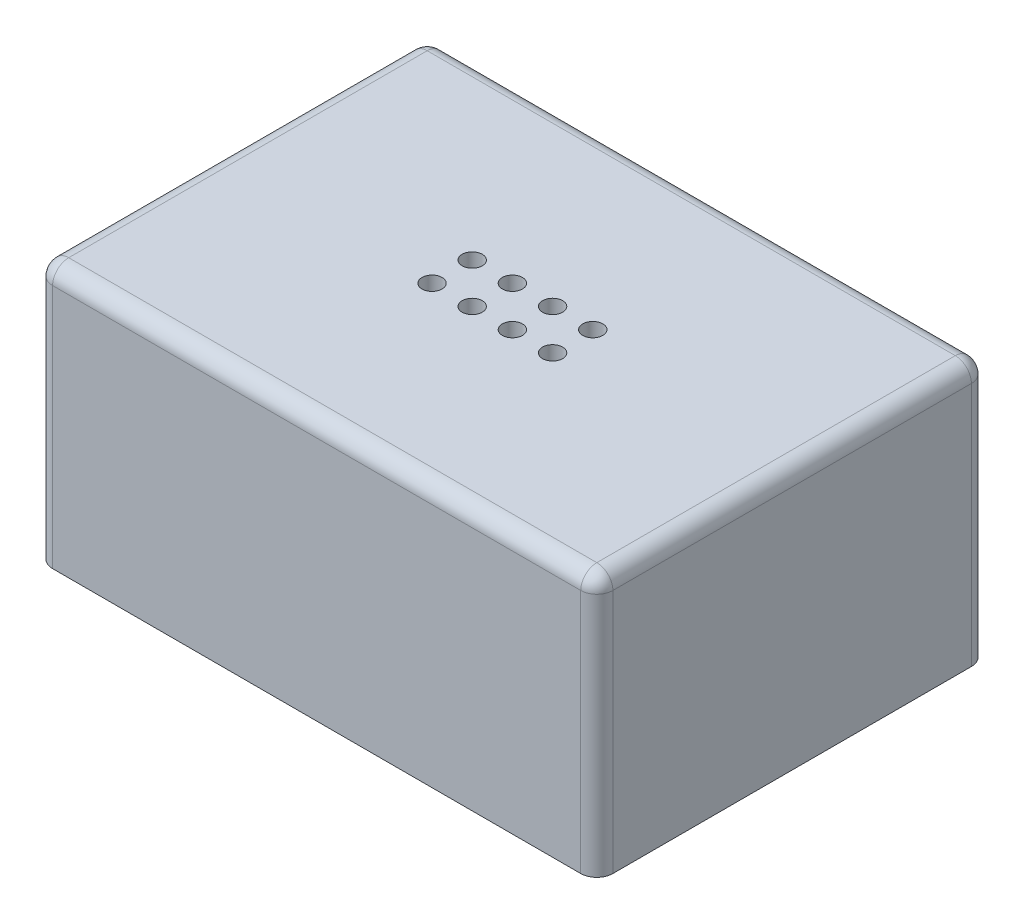
ISO-10303-21;
HEADER;
FILE_DESCRIPTION(('STEP AP214'),'2;1');
FILE_NAME('part.step','',(''),(''),'','','');
FILE_SCHEMA(('AUTOMOTIVE_DESIGN { 1 0 10303 214 1 1 1 1 }'));
ENDSEC;
DATA;
#1=APPLICATION_CONTEXT('core data for automotive mechanical design processes');
#2=APPLICATION_PROTOCOL_DEFINITION('international standard','automotive_design',2000,#1);
#3=PRODUCT_CONTEXT('',#1,'mechanical');
#4=PRODUCT('Part','Part','',(#3));
#5=PRODUCT_RELATED_PRODUCT_CATEGORY('part','',(#4));
#6=PRODUCT_DEFINITION_FORMATION('','',#4);
#7=PRODUCT_DEFINITION_CONTEXT('part definition',#1,'design');
#8=PRODUCT_DEFINITION('design','',#6,#7);
#9=PRODUCT_DEFINITION_SHAPE('','',#8);
#10=(LENGTH_UNIT() NAMED_UNIT(*) SI_UNIT(.MILLI.,.METRE.));
#11=(NAMED_UNIT(*) PLANE_ANGLE_UNIT() SI_UNIT($,.RADIAN.));
#12=(NAMED_UNIT(*) SI_UNIT($,.STERADIAN.) SOLID_ANGLE_UNIT());
#13=UNCERTAINTY_MEASURE_WITH_UNIT(LENGTH_MEASURE(1.E-05),#10,'distance_accuracy_value','');
#14=(GEOMETRIC_REPRESENTATION_CONTEXT(3) GLOBAL_UNCERTAINTY_ASSIGNED_CONTEXT((#13)) GLOBAL_UNIT_ASSIGNED_CONTEXT((#10,
#11,#12)) REPRESENTATION_CONTEXT('',''));
#15=CARTESIAN_POINT('',(0.,0.,0.));
#16=DIRECTION('',(0.,0.,1.));
#17=DIRECTION('',(1.,0.,0.));
#18=AXIS2_PLACEMENT_3D('',#15,#16,#17);
#19=CARTESIAN_POINT('',(0.,0.,0.));
#20=DIRECTION('',(0.,-1.,0.));
#21=DIRECTION('',(0.,0.,-1.));
#22=AXIS2_PLACEMENT_3D('',#19,#20,#21);
#23=PLANE('',#22);
#24=DIRECTION('',(0.,0.,-1.));
#25=VECTOR('',#24,1.);
#26=CARTESIAN_POINT('',(44.2595,0.,30.861));
#27=LINE('',#26,#25);
#28=CARTESIAN_POINT('',(44.2595,0.,28.321));
#29=VERTEX_POINT('',#28);
#30=CARTESIAN_POINT('',(44.2595,0.,-28.321));
#31=VERTEX_POINT('',#30);
#32=EDGE_CURVE('E152',#29,#31,#27,.T.);
#33=ORIENTED_EDGE('',*,*,#32,.F.);
#34=CARTESIAN_POINT('',(41.7195,0.,28.321));
#35=DIRECTION('',(0.,-1.,0.));
#36=DIRECTION('',(0.,0.,-1.));
#37=AXIS2_PLACEMENT_3D('',#34,#35,#36);
#38=CIRCLE('',#37,2.54);
#39=CARTESIAN_POINT('',(41.7195,0.,30.861));
#40=VERTEX_POINT('',#39);
#41=EDGE_CURVE('E206',#29,#40,#38,.T.);
#42=ORIENTED_EDGE('',*,*,#41,.T.);
#43=DIRECTION('',(1.,0.,0.));
#44=VECTOR('',#43,1.);
#45=CARTESIAN_POINT('',(-44.2595,0.,30.861));
#46=LINE('',#45,#44);
#47=CARTESIAN_POINT('',(-41.7195,0.,30.861));
#48=VERTEX_POINT('',#47);
#49=EDGE_CURVE('E190',#48,#40,#46,.T.);
#50=ORIENTED_EDGE('',*,*,#49,.F.);
#51=CARTESIAN_POINT('',(-41.7195,0.,28.321));
#52=DIRECTION('',(0.,-1.,0.));
#53=DIRECTION('',(0.,0.,-1.));
#54=AXIS2_PLACEMENT_3D('',#51,#52,#53);
#55=CIRCLE('',#54,2.54);
#56=CARTESIAN_POINT('',(-44.2595,0.,28.321));
#57=VERTEX_POINT('',#56);
#58=EDGE_CURVE('E200',#48,#57,#55,.T.);
#59=ORIENTED_EDGE('',*,*,#58,.T.);
#60=DIRECTION('',(0.,0.,1.));
#61=VECTOR('',#60,1.);
#62=CARTESIAN_POINT('',(-44.2595,0.,30.861));
#63=LINE('',#62,#61);
#64=CARTESIAN_POINT('',(-44.2595,0.,-28.321));
#65=VERTEX_POINT('',#64);
#66=EDGE_CURVE('E187',#65,#57,#63,.T.);
#67=ORIENTED_EDGE('',*,*,#66,.F.);
#68=CARTESIAN_POINT('',(-41.7195,0.,-28.321));
#69=DIRECTION('',(0.,-1.,0.));
#70=DIRECTION('',(0.,0.,-1.));
#71=AXIS2_PLACEMENT_3D('',#68,#69,#70);
#72=CIRCLE('',#71,2.54);
#73=CARTESIAN_POINT('',(-41.7195,0.,-30.861));
#74=VERTEX_POINT('',#73);
#75=EDGE_CURVE('E202',#65,#74,#72,.T.);
#76=ORIENTED_EDGE('',*,*,#75,.T.);
#77=DIRECTION('',(-1.,0.,0.));
#78=VECTOR('',#77,1.);
#79=CARTESIAN_POINT('',(-44.2595,0.,-30.861));
#80=LINE('',#79,#78);
#81=CARTESIAN_POINT('',(41.7195,0.,-30.861));
#82=VERTEX_POINT('',#81);
#83=EDGE_CURVE('E184',#82,#74,#80,.T.);
#84=ORIENTED_EDGE('',*,*,#83,.F.);
#85=CARTESIAN_POINT('',(41.7195,0.,-28.321));
#86=DIRECTION('',(0.,-1.,0.));
#87=DIRECTION('',(0.,0.,-1.));
#88=AXIS2_PLACEMENT_3D('',#85,#86,#87);
#89=CIRCLE('',#88,2.54);
#90=EDGE_CURVE('E204',#82,#31,#89,.T.);
#91=ORIENTED_EDGE('',*,*,#90,.T.);
#92=EDGE_LOOP('',(#33,#42,#50,#59,#67,#76,#84,#91));
#93=FACE_BOUND('',#92,.T.);
#94=DIRECTION('',(1.,0.,0.));
#95=VECTOR('',#94,1.);
#96=CARTESIAN_POINT('',(-42.672,0.,29.2735));
#97=LINE('',#96,#95);
#98=CARTESIAN_POINT('',(-42.672,0.,29.2735));
#99=VERTEX_POINT('',#98);
#100=CARTESIAN_POINT('',(42.672,0.,29.2735));
#101=VERTEX_POINT('',#100);
#102=EDGE_CURVE('E165',#99,#101,#97,.T.);
#103=ORIENTED_EDGE('',*,*,#102,.T.);
#104=DIRECTION('',(0.,0.,-1.));
#105=VECTOR('',#104,1.);
#106=CARTESIAN_POINT('',(42.672,0.,-29.2735));
#107=LINE('',#106,#105);
#108=CARTESIAN_POINT('',(42.672,0.,-29.2735));
#109=VERTEX_POINT('',#108);
#110=EDGE_CURVE('E148',#101,#109,#107,.T.);
#111=ORIENTED_EDGE('',*,*,#110,.T.);
#112=DIRECTION('',(-1.,0.,0.));
#113=VECTOR('',#112,1.);
#114=CARTESIAN_POINT('',(-42.672,0.,-29.2735));
#115=LINE('',#114,#113);
#116=CARTESIAN_POINT('',(-42.672,0.,-29.2735));
#117=VERTEX_POINT('',#116);
#118=EDGE_CURVE('E156',#109,#117,#115,.T.);
#119=ORIENTED_EDGE('',*,*,#118,.T.);
#120=DIRECTION('',(0.,0.,1.));
#121=VECTOR('',#120,1.);
#122=CARTESIAN_POINT('',(-42.672,0.,-29.2735));
#123=LINE('',#122,#121);
#124=EDGE_CURVE('E162',#117,#99,#123,.T.);
#125=ORIENTED_EDGE('',*,*,#124,.T.);
#126=EDGE_LOOP('',(#103,#111,#119,#125));
#127=FACE_BOUND('',#126,.T.);
#128=ADVANCED_FACE('F32',(#93,#127),#23,.T.);
#129=CARTESIAN_POINT('',(44.2595,41.275,30.861));
#130=DIRECTION('',(-1.,0.,0.));
#131=DIRECTION('',(0.,0.,1.));
#132=AXIS2_PLACEMENT_3D('',#129,#130,#131);
#133=PLANE('',#132);
#134=DIRECTION('',(0.,0.,-1.));
#135=VECTOR('',#134,1.);
#136=CARTESIAN_POINT('',(44.2595,38.735,30.861));
#137=LINE('',#136,#135);
#138=CARTESIAN_POINT('',(44.2595,38.735,-28.321));
#139=VERTEX_POINT('',#138);
#140=CARTESIAN_POINT('',(44.2595,38.735,28.321));
#141=VERTEX_POINT('',#140);
#142=EDGE_CURVE('E193',#139,#141,#137,.F.);
#143=ORIENTED_EDGE('',*,*,#142,.T.);
#144=DIRECTION('',(0.,-1.,0.));
#145=VECTOR('',#144,1.);
#146=CARTESIAN_POINT('',(44.2595,41.275,28.321));
#147=LINE('',#146,#145);
#148=EDGE_CURVE('E197',#141,#29,#147,.T.);
#149=ORIENTED_EDGE('',*,*,#148,.T.);
#150=ORIENTED_EDGE('',*,*,#32,.T.);
#151=DIRECTION('',(0.,-1.,0.));
#152=VECTOR('',#151,1.);
#153=CARTESIAN_POINT('',(44.2595,41.275,-28.321));
#154=LINE('',#153,#152);
#155=EDGE_CURVE('E195',#31,#139,#154,.F.);
#156=ORIENTED_EDGE('',*,*,#155,.T.);
#157=EDGE_LOOP('',(#143,#149,#150,#156));
#158=FACE_BOUND('',#157,.T.);
#159=ADVANCED_FACE('F382',(#158),#133,.F.);
#160=CARTESIAN_POINT('',(-44.2595,41.275,-30.861));
#161=DIRECTION('',(0.,0.,1.));
#162=DIRECTION('',(1.,0.,0.));
#163=AXIS2_PLACEMENT_3D('',#160,#161,#162);
#164=PLANE('',#163);
#165=DIRECTION('',(-1.,0.,0.));
#166=VECTOR('',#165,1.);
#167=CARTESIAN_POINT('',(-44.2595,38.735,-30.861));
#168=LINE('',#167,#166);
#169=CARTESIAN_POINT('',(-41.7195,38.735,-30.861));
#170=VERTEX_POINT('',#169);
#171=CARTESIAN_POINT('',(41.7195,38.735,-30.861));
#172=VERTEX_POINT('',#171);
#173=EDGE_CURVE('E214',#170,#172,#168,.F.);
#174=ORIENTED_EDGE('',*,*,#173,.T.);
#175=DIRECTION('',(0.,-1.,0.));
#176=VECTOR('',#175,1.);
#177=CARTESIAN_POINT('',(41.7195,41.275,-30.861));
#178=LINE('',#177,#176);
#179=EDGE_CURVE('E218',#172,#82,#178,.T.);
#180=ORIENTED_EDGE('',*,*,#179,.T.);
#181=ORIENTED_EDGE('',*,*,#83,.T.);
#182=DIRECTION('',(0.,-1.,0.));
#183=VECTOR('',#182,1.);
#184=CARTESIAN_POINT('',(-41.7195,41.275,-30.861));
#185=LINE('',#184,#183);
#186=EDGE_CURVE('E216',#74,#170,#185,.F.);
#187=ORIENTED_EDGE('',*,*,#186,.T.);
#188=EDGE_LOOP('',(#174,#180,#181,#187));
#189=FACE_BOUND('',#188,.T.);
#190=ADVANCED_FACE('F392',(#189),#164,.F.);
#191=CARTESIAN_POINT('',(-44.2595,41.275,30.861));
#192=DIRECTION('',(1.,0.,0.));
#193=DIRECTION('',(0.,0.,-1.));
#194=AXIS2_PLACEMENT_3D('',#191,#192,#193);
#195=PLANE('',#194);
#196=DIRECTION('',(0.,0.,1.));
#197=VECTOR('',#196,1.);
#198=CARTESIAN_POINT('',(-44.2595,38.735,30.861));
#199=LINE('',#198,#197);
#200=CARTESIAN_POINT('',(-44.2595,38.735,28.321));
#201=VERTEX_POINT('',#200);
#202=CARTESIAN_POINT('',(-44.2595,38.735,-28.321));
#203=VERTEX_POINT('',#202);
#204=EDGE_CURVE('E220',#201,#203,#199,.F.);
#205=ORIENTED_EDGE('',*,*,#204,.T.);
#206=DIRECTION('',(0.,-1.,0.));
#207=VECTOR('',#206,1.);
#208=CARTESIAN_POINT('',(-44.2595,41.275,-28.321));
#209=LINE('',#208,#207);
#210=EDGE_CURVE('E224',#203,#65,#209,.T.);
#211=ORIENTED_EDGE('',*,*,#210,.T.);
#212=ORIENTED_EDGE('',*,*,#66,.T.);
#213=DIRECTION('',(0.,-1.,0.));
#214=VECTOR('',#213,1.);
#215=CARTESIAN_POINT('',(-44.2595,41.275,28.321));
#216=LINE('',#215,#214);
#217=EDGE_CURVE('E222',#57,#201,#216,.F.);
#218=ORIENTED_EDGE('',*,*,#217,.T.);
#219=EDGE_LOOP('',(#205,#211,#212,#218));
#220=FACE_BOUND('',#219,.T.);
#221=ADVANCED_FACE('F428',(#220),#195,.F.);
#222=CARTESIAN_POINT('',(-44.2595,41.275,30.861));
#223=DIRECTION('',(0.,0.,-1.));
#224=DIRECTION('',(-1.,0.,0.));
#225=AXIS2_PLACEMENT_3D('',#222,#223,#224);
#226=PLANE('',#225);
#227=ORIENTED_EDGE('',*,*,#49,.T.);
#228=DIRECTION('',(0.,-1.,0.));
#229=VECTOR('',#228,1.);
#230=CARTESIAN_POINT('',(41.7195,41.275,30.861));
#231=LINE('',#230,#229);
#232=CARTESIAN_POINT('',(41.7195,38.735,30.861));
#233=VERTEX_POINT('',#232);
#234=EDGE_CURVE('E212',#40,#233,#231,.F.);
#235=ORIENTED_EDGE('',*,*,#234,.T.);
#236=DIRECTION('',(1.,0.,0.));
#237=VECTOR('',#236,1.);
#238=CARTESIAN_POINT('',(-44.2595,38.735,30.861));
#239=LINE('',#238,#237);
#240=CARTESIAN_POINT('',(-41.7195,38.735,30.861));
#241=VERTEX_POINT('',#240);
#242=EDGE_CURVE('E208',#233,#241,#239,.F.);
#243=ORIENTED_EDGE('',*,*,#242,.T.);
#244=DIRECTION('',(0.,-1.,0.));
#245=VECTOR('',#244,1.);
#246=CARTESIAN_POINT('',(-41.7195,41.275,30.861));
#247=LINE('',#246,#245);
#248=EDGE_CURVE('E210',#241,#48,#247,.T.);
#249=ORIENTED_EDGE('',*,*,#248,.T.);
#250=EDGE_LOOP('',(#227,#235,#243,#249));
#251=FACE_BOUND('',#250,.T.);
#252=ADVANCED_FACE('F347',(#251),#226,.F.);
#253=CARTESIAN_POINT('',(0.,41.275,0.));
#254=DIRECTION('',(0.,-1.,0.));
#255=DIRECTION('',(0.,0.,-1.));
#256=AXIS2_PLACEMENT_3D('',#253,#254,#255);
#257=PLANE('',#256);
#258=CARTESIAN_POINT('',(-3.17499999999997,41.275,3.11149999999999));
#259=DIRECTION('',(0.,1.,0.));
#260=DIRECTION('',(0.,0.,1.));
#261=AXIS2_PLACEMENT_3D('',#258,#259,#260);
#262=CIRCLE('',#261,1.5875);
#263=CARTESIAN_POINT('',(-3.17499999999997,41.275,4.69899999999999));
#264=VERTEX_POINT('',#263);
#265=EDGE_CURVE('E275',#264,#264,#262,.T.);
#266=ORIENTED_EDGE('',*,*,#265,.F.);
#267=EDGE_LOOP('',(#266));
#268=FACE_BOUND('',#267,.T.);
#269=CARTESIAN_POINT('',(3.17500000000003,41.275,3.11149999999999));
#270=DIRECTION('',(0.,1.,0.));
#271=DIRECTION('',(0.,0.,1.));
#272=AXIS2_PLACEMENT_3D('',#269,#270,#271);
#273=CIRCLE('',#272,1.5875);
#274=CARTESIAN_POINT('',(3.17500000000003,41.275,4.699));
#275=VERTEX_POINT('',#274);
#276=EDGE_CURVE('E335',#275,#275,#273,.T.);
#277=ORIENTED_EDGE('',*,*,#276,.F.);
#278=EDGE_LOOP('',(#277));
#279=FACE_BOUND('',#278,.T.);
#280=CARTESIAN_POINT('',(9.52500000000003,41.275,3.11149999999999));
#281=DIRECTION('',(0.,1.,0.));
#282=DIRECTION('',(0.,0.,1.));
#283=AXIS2_PLACEMENT_3D('',#280,#281,#282);
#284=CIRCLE('',#283,1.5875);
#285=CARTESIAN_POINT('',(9.52500000000003,41.275,4.69899999999999));
#286=VERTEX_POINT('',#285);
#287=EDGE_CURVE('E332',#286,#286,#284,.T.);
#288=ORIENTED_EDGE('',*,*,#287,.F.);
#289=EDGE_LOOP('',(#288));
#290=FACE_BOUND('',#289,.T.);
#291=CARTESIAN_POINT('',(-9.52499999999997,41.275,-3.23850000000001));
#292=DIRECTION('',(0.,1.,0.));
#293=DIRECTION('',(0.,0.,1.));
#294=AXIS2_PLACEMENT_3D('',#291,#292,#293);
#295=CIRCLE('',#294,1.5875);
#296=CARTESIAN_POINT('',(-9.52499999999997,41.275,-1.65100000000001));
#297=VERTEX_POINT('',#296);
#298=EDGE_CURVE('E329',#297,#297,#295,.T.);
#299=ORIENTED_EDGE('',*,*,#298,.F.);
#300=EDGE_LOOP('',(#299));
#301=FACE_BOUND('',#300,.T.);
#302=CARTESIAN_POINT('',(-3.17499999999997,41.275,-3.23850000000001));
#303=DIRECTION('',(0.,1.,0.));
#304=DIRECTION('',(0.,0.,1.));
#305=AXIS2_PLACEMENT_3D('',#302,#303,#304);
#306=CIRCLE('',#305,1.5875);
#307=CARTESIAN_POINT('',(-3.17499999999997,41.275,-1.65100000000001));
#308=VERTEX_POINT('',#307);
#309=EDGE_CURVE('E324',#308,#308,#306,.T.);
#310=ORIENTED_EDGE('',*,*,#309,.F.);
#311=EDGE_LOOP('',(#310));
#312=FACE_BOUND('',#311,.T.);
#313=CARTESIAN_POINT('',(3.17500000000003,41.275,-3.23850000000001));
#314=DIRECTION('',(0.,1.,0.));
#315=DIRECTION('',(0.,0.,1.));
#316=AXIS2_PLACEMENT_3D('',#313,#314,#315);
#317=CIRCLE('',#316,1.5875);
#318=CARTESIAN_POINT('',(3.17500000000003,41.275,-1.65100000000001));
#319=VERTEX_POINT('',#318);
#320=EDGE_CURVE('E320',#319,#319,#317,.T.);
#321=ORIENTED_EDGE('',*,*,#320,.F.);
#322=EDGE_LOOP('',(#321));
#323=FACE_BOUND('',#322,.T.);
#324=CARTESIAN_POINT('',(9.52500000000003,41.275,-3.23850000000001));
#325=DIRECTION('',(0.,1.,0.));
#326=DIRECTION('',(0.,0.,1.));
#327=AXIS2_PLACEMENT_3D('',#324,#325,#326);
#328=CIRCLE('',#327,1.5875);
#329=CARTESIAN_POINT('',(9.52500000000003,41.275,-1.65100000000001));
#330=VERTEX_POINT('',#329);
#331=EDGE_CURVE('E315',#330,#330,#328,.T.);
#332=ORIENTED_EDGE('',*,*,#331,.F.);
#333=EDGE_LOOP('',(#332));
#334=FACE_BOUND('',#333,.T.);
#335=CARTESIAN_POINT('',(-9.52499999999997,41.275,3.11149999999999));
#336=DIRECTION('',(0.,1.,0.));
#337=DIRECTION('',(0.,0.,1.));
#338=AXIS2_PLACEMENT_3D('',#335,#336,#337);
#339=CIRCLE('',#338,1.5875);
#340=CARTESIAN_POINT('',(-9.52499999999997,41.275,4.69899999999999));
#341=VERTEX_POINT('',#340);
#342=EDGE_CURVE('E172',#341,#341,#339,.T.);
#343=ORIENTED_EDGE('',*,*,#342,.F.);
#344=EDGE_LOOP('',(#343));
#345=FACE_BOUND('',#344,.T.);
#346=DIRECTION('',(-1.,0.,0.));
#347=VECTOR('',#346,1.);
#348=CARTESIAN_POINT('',(0.,41.275,-28.321));
#349=LINE('',#348,#347);
#350=CARTESIAN_POINT('',(41.7195,41.275,-28.321));
#351=VERTEX_POINT('',#350);
#352=CARTESIAN_POINT('',(-41.7195,41.275,-28.321));
#353=VERTEX_POINT('',#352);
#354=EDGE_CURVE('E230',#351,#353,#349,.T.);
#355=ORIENTED_EDGE('',*,*,#354,.T.);
#356=DIRECTION('',(0.,0.,1.));
#357=VECTOR('',#356,1.);
#358=CARTESIAN_POINT('',(-41.7195,41.275,0.));
#359=LINE('',#358,#357);
#360=CARTESIAN_POINT('',(-41.7195,41.275,28.321));
#361=VERTEX_POINT('',#360);
#362=EDGE_CURVE('E233',#353,#361,#359,.T.);
#363=ORIENTED_EDGE('',*,*,#362,.T.);
#364=DIRECTION('',(1.,0.,0.));
#365=VECTOR('',#364,1.);
#366=CARTESIAN_POINT('',(0.,41.275,28.321));
#367=LINE('',#366,#365);
#368=CARTESIAN_POINT('',(41.7195,41.275,28.321));
#369=VERTEX_POINT('',#368);
#370=EDGE_CURVE('E228',#361,#369,#367,.T.);
#371=ORIENTED_EDGE('',*,*,#370,.T.);
#372=DIRECTION('',(0.,0.,-1.));
#373=VECTOR('',#372,1.);
#374=CARTESIAN_POINT('',(41.7195,41.275,0.));
#375=LINE('',#374,#373);
#376=EDGE_CURVE('E226',#369,#351,#375,.T.);
#377=ORIENTED_EDGE('',*,*,#376,.T.);
#378=EDGE_LOOP('',(#355,#363,#371,#377));
#379=FACE_BOUND('',#378,.T.);
#380=ADVANCED_FACE('F344',(#268,#279,#290,#301,#312,#323,#334,#345,#379),#257,.F.);
#381=CARTESIAN_POINT('',(42.672,38.1,-29.2735));
#382=DIRECTION('',(-1.,0.,0.));
#383=DIRECTION('',(0.,0.,1.));
#384=AXIS2_PLACEMENT_3D('',#381,#382,#383);
#385=PLANE('',#384);
#386=DIRECTION('',(0.,-1.,0.));
#387=VECTOR('',#386,1.);
#388=CARTESIAN_POINT('',(42.672,38.1,29.2735));
#389=LINE('',#388,#387);
#390=CARTESIAN_POINT('',(42.672,35.56,29.2735));
#391=VERTEX_POINT('',#390);
#392=EDGE_CURVE('E177',#391,#101,#389,.T.);
#393=ORIENTED_EDGE('',*,*,#392,.F.);
#394=DIRECTION('',(0.,0.,-1.));
#395=VECTOR('',#394,1.);
#396=CARTESIAN_POINT('',(42.672,35.56,-29.2735));
#397=LINE('',#396,#395);
#398=CARTESIAN_POINT('',(42.672,35.56,-29.2735));
#399=VERTEX_POINT('',#398);
#400=EDGE_CURVE('E11',#391,#399,#397,.T.);
#401=ORIENTED_EDGE('',*,*,#400,.T.);
#402=DIRECTION('',(0.,-1.,0.));
#403=VECTOR('',#402,1.);
#404=CARTESIAN_POINT('',(42.672,38.1,-29.2735));
#405=LINE('',#404,#403);
#406=EDGE_CURVE('E144',#399,#109,#405,.T.);
#407=ORIENTED_EDGE('',*,*,#406,.T.);
#408=ORIENTED_EDGE('',*,*,#110,.F.);
#409=EDGE_LOOP('',(#393,#401,#407,#408));
#410=FACE_BOUND('',#409,.T.);
#411=ADVANCED_FACE('F146',(#410),#385,.T.);
#412=CARTESIAN_POINT('',(-42.672,38.1,-29.2735));
#413=DIRECTION('',(0.,0.,1.));
#414=DIRECTION('',(1.,0.,0.));
#415=AXIS2_PLACEMENT_3D('',#412,#413,#414);
#416=PLANE('',#415);
#417=ORIENTED_EDGE('',*,*,#406,.F.);
#418=DIRECTION('',(-1.,0.,0.));
#419=VECTOR('',#418,1.);
#420=CARTESIAN_POINT('',(-42.672,35.56,-29.2735));
#421=LINE('',#420,#419);
#422=CARTESIAN_POINT('',(-42.672,35.56,-29.2735));
#423=VERTEX_POINT('',#422);
#424=EDGE_CURVE('E41',#399,#423,#421,.T.);
#425=ORIENTED_EDGE('',*,*,#424,.T.);
#426=DIRECTION('',(0.,-1.,0.));
#427=VECTOR('',#426,1.);
#428=CARTESIAN_POINT('',(-42.672,38.1,-29.2735));
#429=LINE('',#428,#427);
#430=EDGE_CURVE('E153',#423,#117,#429,.T.);
#431=ORIENTED_EDGE('',*,*,#430,.T.);
#432=ORIENTED_EDGE('',*,*,#118,.F.);
#433=EDGE_LOOP('',(#417,#425,#431,#432));
#434=FACE_BOUND('',#433,.T.);
#435=ADVANCED_FACE('F157',(#434),#416,.T.);
#436=CARTESIAN_POINT('',(-42.672,38.1,-29.2735));
#437=DIRECTION('',(1.,0.,0.));
#438=DIRECTION('',(0.,0.,-1.));
#439=AXIS2_PLACEMENT_3D('',#436,#437,#438);
#440=PLANE('',#439);
#441=ORIENTED_EDGE('',*,*,#430,.F.);
#442=DIRECTION('',(0.,0.,1.));
#443=VECTOR('',#442,1.);
#444=CARTESIAN_POINT('',(-42.672,35.56,-29.2735));
#445=LINE('',#444,#443);
#446=CARTESIAN_POINT('',(-42.672,35.56,29.2735));
#447=VERTEX_POINT('',#446);
#448=EDGE_CURVE('E235',#423,#447,#445,.T.);
#449=ORIENTED_EDGE('',*,*,#448,.T.);
#450=DIRECTION('',(0.,-1.,0.));
#451=VECTOR('',#450,1.);
#452=CARTESIAN_POINT('',(-42.672,38.1,29.2735));
#453=LINE('',#452,#451);
#454=EDGE_CURVE('E179',#447,#99,#453,.T.);
#455=ORIENTED_EDGE('',*,*,#454,.T.);
#456=ORIENTED_EDGE('',*,*,#124,.F.);
#457=EDGE_LOOP('',(#441,#449,#455,#456));
#458=FACE_BOUND('',#457,.T.);
#459=ADVANCED_FACE('F448',(#458),#440,.T.);
#460=CARTESIAN_POINT('',(-42.672,38.1,29.2735));
#461=DIRECTION('',(0.,0.,-1.));
#462=DIRECTION('',(-1.,0.,0.));
#463=AXIS2_PLACEMENT_3D('',#460,#461,#462);
#464=PLANE('',#463);
#465=ORIENTED_EDGE('',*,*,#454,.F.);
#466=DIRECTION('',(1.,0.,0.));
#467=VECTOR('',#466,1.);
#468=CARTESIAN_POINT('',(-42.672,35.56,29.2735));
#469=LINE('',#468,#467);
#470=EDGE_CURVE('E55',#447,#391,#469,.T.);
#471=ORIENTED_EDGE('',*,*,#470,.T.);
#472=ORIENTED_EDGE('',*,*,#392,.T.);
#473=ORIENTED_EDGE('',*,*,#102,.F.);
#474=EDGE_LOOP('',(#465,#471,#472,#473));
#475=FACE_BOUND('',#474,.T.);
#476=ADVANCED_FACE('F451',(#475),#464,.T.);
#477=CARTESIAN_POINT('',(0.,38.1,0.));
#478=DIRECTION('',(0.,1.,0.));
#479=DIRECTION('',(0.,0.,1.));
#480=AXIS2_PLACEMENT_3D('',#477,#478,#479);
#481=PLANE('',#480);
#482=DIRECTION('',(1.,0.,0.));
#483=VECTOR('',#482,1.);
#484=CARTESIAN_POINT('',(0.,38.1,26.7335));
#485=LINE('',#484,#483);
#486=CARTESIAN_POINT('',(40.132,38.1,26.7335));
#487=VERTEX_POINT('',#486);
#488=CARTESIAN_POINT('',(-40.132,38.1,26.7335));
#489=VERTEX_POINT('',#488);
#490=EDGE_CURVE('E299',#487,#489,#485,.F.);
#491=ORIENTED_EDGE('',*,*,#490,.T.);
#492=DIRECTION('',(0.,0.,1.));
#493=VECTOR('',#492,1.);
#494=CARTESIAN_POINT('',(-40.132,38.1,0.));
#495=LINE('',#494,#493);
#496=CARTESIAN_POINT('',(-40.132,38.1,-26.7335));
#497=VERTEX_POINT('',#496);
#498=EDGE_CURVE('E301',#489,#497,#495,.F.);
#499=ORIENTED_EDGE('',*,*,#498,.T.);
#500=DIRECTION('',(-1.,0.,0.));
#501=VECTOR('',#500,1.);
#502=CARTESIAN_POINT('',(0.,38.1,-26.7335));
#503=LINE('',#502,#501);
#504=CARTESIAN_POINT('',(40.132,38.1,-26.7335));
#505=VERTEX_POINT('',#504);
#506=EDGE_CURVE('E297',#497,#505,#503,.F.);
#507=ORIENTED_EDGE('',*,*,#506,.T.);
#508=DIRECTION('',(0.,0.,-1.));
#509=VECTOR('',#508,1.);
#510=CARTESIAN_POINT('',(40.132,38.1,0.));
#511=LINE('',#510,#509);
#512=EDGE_CURVE('E295',#505,#487,#511,.F.);
#513=ORIENTED_EDGE('',*,*,#512,.T.);
#514=EDGE_LOOP('',(#491,#499,#507,#513));
#515=FACE_BOUND('',#514,.T.);
#516=CARTESIAN_POINT('',(-3.17499999999997,38.1,3.11149999999999));
#517=DIRECTION('',(0.,1.,0.));
#518=DIRECTION('',(0.,0.,1.));
#519=AXIS2_PLACEMENT_3D('',#516,#517,#518);
#520=CIRCLE('',#519,1.5875);
#521=CARTESIAN_POINT('',(-3.17499999999997,38.1,4.69899999999999));
#522=VERTEX_POINT('',#521);
#523=EDGE_CURVE('E290',#522,#522,#520,.T.);
#524=ORIENTED_EDGE('',*,*,#523,.T.);
#525=EDGE_LOOP('',(#524));
#526=FACE_BOUND('',#525,.T.);
#527=CARTESIAN_POINT('',(3.17500000000003,38.1,3.11149999999999));
#528=DIRECTION('',(0.,1.,0.));
#529=DIRECTION('',(0.,0.,1.));
#530=AXIS2_PLACEMENT_3D('',#527,#528,#529);
#531=CIRCLE('',#530,1.5875);
#532=CARTESIAN_POINT('',(3.17500000000003,38.1,4.699));
#533=VERTEX_POINT('',#532);
#534=EDGE_CURVE('E287',#533,#533,#531,.T.);
#535=ORIENTED_EDGE('',*,*,#534,.T.);
#536=EDGE_LOOP('',(#535));
#537=FACE_BOUND('',#536,.T.);
#538=CARTESIAN_POINT('',(9.52500000000003,38.1,3.11149999999999));
#539=DIRECTION('',(0.,1.,0.));
#540=DIRECTION('',(0.,0.,1.));
#541=AXIS2_PLACEMENT_3D('',#538,#539,#540);
#542=CIRCLE('',#541,1.5875);
#543=CARTESIAN_POINT('',(9.52500000000003,38.1,4.69899999999999));
#544=VERTEX_POINT('',#543);
#545=EDGE_CURVE('E284',#544,#544,#542,.T.);
#546=ORIENTED_EDGE('',*,*,#545,.T.);
#547=EDGE_LOOP('',(#546));
#548=FACE_BOUND('',#547,.T.);
#549=CARTESIAN_POINT('',(-9.52499999999997,38.1,-3.23850000000001));
#550=DIRECTION('',(0.,1.,0.));
#551=DIRECTION('',(0.,0.,1.));
#552=AXIS2_PLACEMENT_3D('',#549,#550,#551);
#553=CIRCLE('',#552,1.5875);
#554=CARTESIAN_POINT('',(-9.52499999999997,38.1,-1.65100000000001));
#555=VERTEX_POINT('',#554);
#556=EDGE_CURVE('E281',#555,#555,#553,.T.);
#557=ORIENTED_EDGE('',*,*,#556,.T.);
#558=EDGE_LOOP('',(#557));
#559=FACE_BOUND('',#558,.T.);
#560=CARTESIAN_POINT('',(-3.17499999999997,38.1,-3.23850000000001));
#561=DIRECTION('',(0.,1.,0.));
#562=DIRECTION('',(0.,0.,1.));
#563=AXIS2_PLACEMENT_3D('',#560,#561,#562);
#564=CIRCLE('',#563,1.5875);
#565=CARTESIAN_POINT('',(-3.17499999999997,38.1,-1.65100000000001));
#566=VERTEX_POINT('',#565);
#567=EDGE_CURVE('E278',#566,#566,#564,.T.);
#568=ORIENTED_EDGE('',*,*,#567,.T.);
#569=EDGE_LOOP('',(#568));
#570=FACE_BOUND('',#569,.T.);
#571=CARTESIAN_POINT('',(3.17500000000003,38.1,-3.23850000000001));
#572=DIRECTION('',(0.,1.,0.));
#573=DIRECTION('',(0.,0.,1.));
#574=AXIS2_PLACEMENT_3D('',#571,#572,#573);
#575=CIRCLE('',#574,1.5875);
#576=CARTESIAN_POINT('',(3.17500000000003,38.1,-1.65100000000001));
#577=VERTEX_POINT('',#576);
#578=EDGE_CURVE('E274',#577,#577,#575,.T.);
#579=ORIENTED_EDGE('',*,*,#578,.T.);
#580=EDGE_LOOP('',(#579));
#581=FACE_BOUND('',#580,.T.);
#582=CARTESIAN_POINT('',(9.52500000000003,38.1,-3.23850000000001));
#583=DIRECTION('',(0.,1.,0.));
#584=DIRECTION('',(0.,0.,1.));
#585=AXIS2_PLACEMENT_3D('',#582,#583,#584);
#586=CIRCLE('',#585,1.5875);
#587=CARTESIAN_POINT('',(9.52500000000003,38.1,-1.65100000000001));
#588=VERTEX_POINT('',#587);
#589=EDGE_CURVE('E271',#588,#588,#586,.T.);
#590=ORIENTED_EDGE('',*,*,#589,.T.);
#591=EDGE_LOOP('',(#590));
#592=FACE_BOUND('',#591,.T.);
#593=CARTESIAN_POINT('',(-9.52499999999997,38.1,3.11149999999999));
#594=DIRECTION('',(0.,1.,0.));
#595=DIRECTION('',(0.,0.,1.));
#596=AXIS2_PLACEMENT_3D('',#593,#594,#595);
#597=CIRCLE('',#596,1.5875);
#598=CARTESIAN_POINT('',(-9.52499999999997,38.1,4.69899999999999));
#599=VERTEX_POINT('',#598);
#600=EDGE_CURVE('E240',#599,#599,#597,.T.);
#601=ORIENTED_EDGE('',*,*,#600,.T.);
#602=EDGE_LOOP('',(#601));
#603=FACE_BOUND('',#602,.T.);
#604=ADVANCED_FACE('F455',(#515,#526,#537,#548,#559,#570,#581,#592,#603),#481,.F.);
#605=CARTESIAN_POINT('',(-41.7195,41.275,-28.321));
#606=DIRECTION('',(0.,-1.,0.));
#607=DIRECTION('',(0.,0.,-1.));
#608=AXIS2_PLACEMENT_3D('',#605,#606,#607);
#609=CYLINDRICAL_SURFACE('',#608,2.54);
#610=CARTESIAN_POINT('',(-41.7195,38.735,-28.321));
#611=DIRECTION('',(0.,1.,0.));
#612=DIRECTION('',(0.,0.,1.));
#613=AXIS2_PLACEMENT_3D('',#610,#611,#612);
#614=CIRCLE('',#613,2.54);
#615=EDGE_CURVE('E166',#170,#203,#614,.T.);
#616=ORIENTED_EDGE('',*,*,#615,.F.);
#617=ORIENTED_EDGE('',*,*,#186,.F.);
#618=ORIENTED_EDGE('',*,*,#75,.F.);
#619=ORIENTED_EDGE('',*,*,#210,.F.);
#620=EDGE_LOOP('',(#616,#617,#618,#619));
#621=FACE_BOUND('',#620,.T.);
#622=ADVANCED_FACE('F400',(#621),#609,.T.);
#623=CARTESIAN_POINT('',(-41.7195,38.735,-28.321));
#624=DIRECTION('',(0.,0.,1.));
#625=DIRECTION('',(1.,0.,0.));
#626=AXIS2_PLACEMENT_3D('',#623,#624,#625);
#627=SPHERICAL_SURFACE('',#626,2.54);
#628=CARTESIAN_POINT('',(-41.7195,38.735,-28.321));
#629=DIRECTION('',(-1.,0.,0.));
#630=DIRECTION('',(0.,0.,1.));
#631=AXIS2_PLACEMENT_3D('',#628,#629,#630);
#632=CIRCLE('',#631,2.54);
#633=EDGE_CURVE('E264',#170,#353,#632,.F.);
#634=ORIENTED_EDGE('',*,*,#633,.F.);
#635=ORIENTED_EDGE('',*,*,#615,.T.);
#636=CARTESIAN_POINT('',(-41.7195,38.735,-28.321));
#637=DIRECTION('',(0.,0.,-1.));
#638=DIRECTION('',(0.,1.,0.));
#639=AXIS2_PLACEMENT_3D('',#636,#637,#638);
#640=CIRCLE('',#639,2.54);
#641=EDGE_CURVE('E169',#353,#203,#640,.F.);
#642=ORIENTED_EDGE('',*,*,#641,.F.);
#643=EDGE_LOOP('',(#634,#635,#642));
#644=FACE_BOUND('',#643,.T.);
#645=ADVANCED_FACE('F403',(#644),#627,.T.);
#646=CARTESIAN_POINT('',(-41.7195,41.275,28.321));
#647=DIRECTION('',(0.,-1.,0.));
#648=DIRECTION('',(0.,0.,-1.));
#649=AXIS2_PLACEMENT_3D('',#646,#647,#648);
#650=CYLINDRICAL_SURFACE('',#649,2.54);
#651=ORIENTED_EDGE('',*,*,#58,.F.);
#652=ORIENTED_EDGE('',*,*,#248,.F.);
#653=CARTESIAN_POINT('',(-41.7195,38.735,28.321));
#654=DIRECTION('',(0.,1.,0.));
#655=DIRECTION('',(0.,0.,1.));
#656=AXIS2_PLACEMENT_3D('',#653,#654,#655);
#657=CIRCLE('',#656,2.54);
#658=EDGE_CURVE('E261',#201,#241,#657,.T.);
#659=ORIENTED_EDGE('',*,*,#658,.F.);
#660=ORIENTED_EDGE('',*,*,#217,.F.);
#661=EDGE_LOOP('',(#651,#652,#659,#660));
#662=FACE_BOUND('',#661,.T.);
#663=ADVANCED_FACE('F425',(#662),#650,.T.);
#664=CARTESIAN_POINT('',(-41.7195,38.735,0.));
#665=DIRECTION('',(0.,0.,1.));
#666=DIRECTION('',(1.,0.,0.));
#667=AXIS2_PLACEMENT_3D('',#664,#665,#666);
#668=CYLINDRICAL_SURFACE('',#667,2.54);
#669=ORIENTED_EDGE('',*,*,#641,.T.);
#670=ORIENTED_EDGE('',*,*,#204,.F.);
#671=CARTESIAN_POINT('',(-41.7195,38.735,28.321));
#672=DIRECTION('',(0.,0.,1.));
#673=DIRECTION('',(1.,0.,0.));
#674=AXIS2_PLACEMENT_3D('',#671,#672,#673);
#675=CIRCLE('',#674,2.54);
#676=EDGE_CURVE('E258',#361,#201,#675,.T.);
#677=ORIENTED_EDGE('',*,*,#676,.F.);
#678=ORIENTED_EDGE('',*,*,#362,.F.);
#679=EDGE_LOOP('',(#669,#670,#677,#678));
#680=FACE_BOUND('',#679,.T.);
#681=ADVANCED_FACE('F406',(#680),#668,.T.);
#682=CARTESIAN_POINT('',(0.,38.735,-28.321));
#683=DIRECTION('',(-1.,0.,0.));
#684=DIRECTION('',(0.,0.,1.));
#685=AXIS2_PLACEMENT_3D('',#682,#683,#684);
#686=CYLINDRICAL_SURFACE('',#685,2.54);
#687=ORIENTED_EDGE('',*,*,#633,.T.);
#688=ORIENTED_EDGE('',*,*,#354,.F.);
#689=CARTESIAN_POINT('',(41.7195,38.735,-28.321));
#690=DIRECTION('',(1.,0.,0.));
#691=DIRECTION('',(0.,0.,-1.));
#692=AXIS2_PLACEMENT_3D('',#689,#690,#691);
#693=CIRCLE('',#692,2.54);
#694=EDGE_CURVE('E255',#172,#351,#693,.T.);
#695=ORIENTED_EDGE('',*,*,#694,.F.);
#696=ORIENTED_EDGE('',*,*,#173,.F.);
#697=EDGE_LOOP('',(#687,#688,#695,#696));
#698=FACE_BOUND('',#697,.T.);
#699=ADVANCED_FACE('F368',(#698),#686,.T.);
#700=CARTESIAN_POINT('',(41.7195,41.275,-28.321));
#701=DIRECTION('',(0.,-1.,0.));
#702=DIRECTION('',(0.,0.,-1.));
#703=AXIS2_PLACEMENT_3D('',#700,#701,#702);
#704=CYLINDRICAL_SURFACE('',#703,2.54);
#705=ORIENTED_EDGE('',*,*,#90,.F.);
#706=ORIENTED_EDGE('',*,*,#179,.F.);
#707=CARTESIAN_POINT('',(41.7195,38.735,-28.321));
#708=DIRECTION('',(0.,1.,0.));
#709=DIRECTION('',(0.,0.,1.));
#710=AXIS2_PLACEMENT_3D('',#707,#708,#709);
#711=CIRCLE('',#710,2.54);
#712=EDGE_CURVE('E252',#139,#172,#711,.T.);
#713=ORIENTED_EDGE('',*,*,#712,.F.);
#714=ORIENTED_EDGE('',*,*,#155,.F.);
#715=EDGE_LOOP('',(#705,#706,#713,#714));
#716=FACE_BOUND('',#715,.T.);
#717=ADVANCED_FACE('F389',(#716),#704,.T.);
#718=CARTESIAN_POINT('',(-41.7195,38.735,28.321));
#719=DIRECTION('',(0.,0.,1.));
#720=DIRECTION('',(1.,0.,0.));
#721=AXIS2_PLACEMENT_3D('',#718,#719,#720);
#722=SPHERICAL_SURFACE('',#721,2.54);
#723=ORIENTED_EDGE('',*,*,#676,.T.);
#724=ORIENTED_EDGE('',*,*,#658,.T.);
#725=CARTESIAN_POINT('',(-41.7195,38.735,28.321));
#726=DIRECTION('',(-1.,0.,0.));
#727=DIRECTION('',(0.,0.,1.));
#728=AXIS2_PLACEMENT_3D('',#725,#726,#727);
#729=CIRCLE('',#728,2.54);
#730=EDGE_CURVE('E249',#361,#241,#729,.F.);
#731=ORIENTED_EDGE('',*,*,#730,.F.);
#732=EDGE_LOOP('',(#723,#724,#731));
#733=FACE_BOUND('',#732,.T.);
#734=ADVANCED_FACE('F411',(#733),#722,.T.);
#735=CARTESIAN_POINT('',(41.7195,38.735,-28.321));
#736=DIRECTION('',(0.,0.,1.));
#737=DIRECTION('',(1.,0.,0.));
#738=AXIS2_PLACEMENT_3D('',#735,#736,#737);
#739=SPHERICAL_SURFACE('',#738,2.54);
#740=ORIENTED_EDGE('',*,*,#712,.T.);
#741=ORIENTED_EDGE('',*,*,#694,.T.);
#742=CARTESIAN_POINT('',(41.7195,38.735,-28.321));
#743=DIRECTION('',(0.,0.,-1.));
#744=DIRECTION('',(-1.,0.,0.));
#745=AXIS2_PLACEMENT_3D('',#742,#743,#744);
#746=CIRCLE('',#745,2.54);
#747=EDGE_CURVE('E246',#139,#351,#746,.F.);
#748=ORIENTED_EDGE('',*,*,#747,.F.);
#749=EDGE_LOOP('',(#740,#741,#748));
#750=FACE_BOUND('',#749,.T.);
#751=ADVANCED_FACE('F373',(#750),#739,.T.);
#752=CARTESIAN_POINT('',(0.,38.735,28.321));
#753=DIRECTION('',(1.,0.,0.));
#754=DIRECTION('',(0.,0.,-1.));
#755=AXIS2_PLACEMENT_3D('',#752,#753,#754);
#756=CYLINDRICAL_SURFACE('',#755,2.54);
#757=ORIENTED_EDGE('',*,*,#730,.T.);
#758=ORIENTED_EDGE('',*,*,#242,.F.);
#759=CARTESIAN_POINT('',(41.7195,38.735,28.321));
#760=DIRECTION('',(1.,0.,0.));
#761=DIRECTION('',(0.,0.,-1.));
#762=AXIS2_PLACEMENT_3D('',#759,#760,#761);
#763=CIRCLE('',#762,2.54);
#764=EDGE_CURVE('E243',#369,#233,#763,.T.);
#765=ORIENTED_EDGE('',*,*,#764,.F.);
#766=ORIENTED_EDGE('',*,*,#370,.F.);
#767=EDGE_LOOP('',(#757,#758,#765,#766));
#768=FACE_BOUND('',#767,.T.);
#769=ADVANCED_FACE('F414',(#768),#756,.T.);
#770=CARTESIAN_POINT('',(41.7195,38.735,0.));
#771=DIRECTION('',(0.,0.,-1.));
#772=DIRECTION('',(-1.,0.,0.));
#773=AXIS2_PLACEMENT_3D('',#770,#771,#772);
#774=CYLINDRICAL_SURFACE('',#773,2.54);
#775=ORIENTED_EDGE('',*,*,#747,.T.);
#776=ORIENTED_EDGE('',*,*,#376,.F.);
#777=CARTESIAN_POINT('',(41.7195,38.735,28.321));
#778=DIRECTION('',(0.,0.,1.));
#779=DIRECTION('',(1.,0.,0.));
#780=AXIS2_PLACEMENT_3D('',#777,#778,#779);
#781=CIRCLE('',#780,2.54);
#782=EDGE_CURVE('E239',#141,#369,#781,.T.);
#783=ORIENTED_EDGE('',*,*,#782,.F.);
#784=ORIENTED_EDGE('',*,*,#142,.F.);
#785=EDGE_LOOP('',(#775,#776,#783,#784));
#786=FACE_BOUND('',#785,.T.);
#787=ADVANCED_FACE('F377',(#786),#774,.T.);
#788=CARTESIAN_POINT('',(41.7195,38.735,28.321));
#789=DIRECTION('',(0.,0.,1.));
#790=DIRECTION('',(1.,0.,0.));
#791=AXIS2_PLACEMENT_3D('',#788,#789,#790);
#792=SPHERICAL_SURFACE('',#791,2.54);
#793=ORIENTED_EDGE('',*,*,#782,.T.);
#794=ORIENTED_EDGE('',*,*,#764,.T.);
#795=CARTESIAN_POINT('',(41.7195,38.735,28.321));
#796=DIRECTION('',(0.,1.,0.));
#797=DIRECTION('',(0.,0.,1.));
#798=AXIS2_PLACEMENT_3D('',#795,#796,#797);
#799=CIRCLE('',#798,2.54);
#800=EDGE_CURVE('E236',#141,#233,#799,.F.);
#801=ORIENTED_EDGE('',*,*,#800,.F.);
#802=EDGE_LOOP('',(#793,#794,#801));
#803=FACE_BOUND('',#802,.T.);
#804=ADVANCED_FACE('F416',(#803),#792,.T.);
#805=CARTESIAN_POINT('',(41.7195,41.275,28.321));
#806=DIRECTION('',(0.,-1.,0.));
#807=DIRECTION('',(0.,0.,-1.));
#808=AXIS2_PLACEMENT_3D('',#805,#806,#807);
#809=CYLINDRICAL_SURFACE('',#808,2.54);
#810=ORIENTED_EDGE('',*,*,#800,.T.);
#811=ORIENTED_EDGE('',*,*,#234,.F.);
#812=ORIENTED_EDGE('',*,*,#41,.F.);
#813=ORIENTED_EDGE('',*,*,#148,.F.);
#814=EDGE_LOOP('',(#810,#811,#812,#813));
#815=FACE_BOUND('',#814,.T.);
#816=ADVANCED_FACE('F419',(#815),#809,.T.);
#817=CARTESIAN_POINT('',(-9.52499999999997,0.,3.11149999999999));
#818=DIRECTION('',(0.,1.,0.));
#819=DIRECTION('',(0.,0.,1.));
#820=AXIS2_PLACEMENT_3D('',#817,#818,#819);
#821=CYLINDRICAL_SURFACE('',#820,1.5875);
#822=ORIENTED_EDGE('',*,*,#342,.T.);
#823=EDGE_LOOP('',(#822));
#824=FACE_BOUND('',#823,.T.);
#825=ORIENTED_EDGE('',*,*,#600,.F.);
#826=EDGE_LOOP('',(#825));
#827=FACE_BOUND('',#826,.T.);
#828=ADVANCED_FACE('F459',(#824,#827),#821,.F.);
#829=CARTESIAN_POINT('',(9.52500000000003,0.,-3.23850000000001));
#830=DIRECTION('',(0.,1.,0.));
#831=DIRECTION('',(0.,0.,1.));
#832=AXIS2_PLACEMENT_3D('',#829,#830,#831);
#833=CYLINDRICAL_SURFACE('',#832,1.5875);
#834=ORIENTED_EDGE('',*,*,#331,.T.);
#835=EDGE_LOOP('',(#834));
#836=FACE_BOUND('',#835,.T.);
#837=ORIENTED_EDGE('',*,*,#589,.F.);
#838=EDGE_LOOP('',(#837));
#839=FACE_BOUND('',#838,.T.);
#840=ADVANCED_FACE('F462',(#836,#839),#833,.F.);
#841=CARTESIAN_POINT('',(3.17500000000003,0.,-3.23850000000001));
#842=DIRECTION('',(0.,1.,0.));
#843=DIRECTION('',(0.,0.,1.));
#844=AXIS2_PLACEMENT_3D('',#841,#842,#843);
#845=CYLINDRICAL_SURFACE('',#844,1.5875);
#846=ORIENTED_EDGE('',*,*,#320,.T.);
#847=EDGE_LOOP('',(#846));
#848=FACE_BOUND('',#847,.T.);
#849=ORIENTED_EDGE('',*,*,#578,.F.);
#850=EDGE_LOOP('',(#849));
#851=FACE_BOUND('',#850,.T.);
#852=ADVANCED_FACE('F466',(#848,#851),#845,.F.);
#853=CARTESIAN_POINT('',(-3.17499999999997,0.,-3.23850000000001));
#854=DIRECTION('',(0.,1.,0.));
#855=DIRECTION('',(0.,0.,1.));
#856=AXIS2_PLACEMENT_3D('',#853,#854,#855);
#857=CYLINDRICAL_SURFACE('',#856,1.5875);
#858=ORIENTED_EDGE('',*,*,#309,.T.);
#859=EDGE_LOOP('',(#858));
#860=FACE_BOUND('',#859,.T.);
#861=ORIENTED_EDGE('',*,*,#567,.F.);
#862=EDGE_LOOP('',(#861));
#863=FACE_BOUND('',#862,.T.);
#864=ADVANCED_FACE('F469',(#860,#863),#857,.F.);
#865=CARTESIAN_POINT('',(-9.52499999999997,0.,-3.23850000000001));
#866=DIRECTION('',(0.,1.,0.));
#867=DIRECTION('',(0.,0.,1.));
#868=AXIS2_PLACEMENT_3D('',#865,#866,#867);
#869=CYLINDRICAL_SURFACE('',#868,1.5875);
#870=ORIENTED_EDGE('',*,*,#298,.T.);
#871=EDGE_LOOP('',(#870));
#872=FACE_BOUND('',#871,.T.);
#873=ORIENTED_EDGE('',*,*,#556,.F.);
#874=EDGE_LOOP('',(#873));
#875=FACE_BOUND('',#874,.T.);
#876=ADVANCED_FACE('F473',(#872,#875),#869,.F.);
#877=CARTESIAN_POINT('',(9.52500000000003,0.,3.11149999999999));
#878=DIRECTION('',(0.,1.,0.));
#879=DIRECTION('',(0.,0.,1.));
#880=AXIS2_PLACEMENT_3D('',#877,#878,#879);
#881=CYLINDRICAL_SURFACE('',#880,1.5875);
#882=ORIENTED_EDGE('',*,*,#287,.T.);
#883=EDGE_LOOP('',(#882));
#884=FACE_BOUND('',#883,.T.);
#885=ORIENTED_EDGE('',*,*,#545,.F.);
#886=EDGE_LOOP('',(#885));
#887=FACE_BOUND('',#886,.T.);
#888=ADVANCED_FACE('F477',(#884,#887),#881,.F.);
#889=CARTESIAN_POINT('',(3.17500000000003,0.,3.11149999999999));
#890=DIRECTION('',(0.,1.,0.));
#891=DIRECTION('',(0.,0.,1.));
#892=AXIS2_PLACEMENT_3D('',#889,#890,#891);
#893=CYLINDRICAL_SURFACE('',#892,1.5875);
#894=ORIENTED_EDGE('',*,*,#276,.T.);
#895=EDGE_LOOP('',(#894));
#896=FACE_BOUND('',#895,.T.);
#897=ORIENTED_EDGE('',*,*,#534,.F.);
#898=EDGE_LOOP('',(#897));
#899=FACE_BOUND('',#898,.T.);
#900=ADVANCED_FACE('F481',(#896,#899),#893,.F.);
#901=CARTESIAN_POINT('',(-3.17499999999997,0.,3.11149999999999));
#902=DIRECTION('',(0.,1.,0.));
#903=DIRECTION('',(0.,0.,1.));
#904=AXIS2_PLACEMENT_3D('',#901,#902,#903);
#905=CYLINDRICAL_SURFACE('',#904,1.5875);
#906=ORIENTED_EDGE('',*,*,#265,.T.);
#907=EDGE_LOOP('',(#906));
#908=FACE_BOUND('',#907,.T.);
#909=ORIENTED_EDGE('',*,*,#523,.F.);
#910=EDGE_LOOP('',(#909));
#911=FACE_BOUND('',#910,.T.);
#912=ADVANCED_FACE('F341',(#908,#911),#905,.F.);
#913=CARTESIAN_POINT('',(40.132,35.56,-29.2735));
#914=DIRECTION('',(0.,0.,-1.));
#915=DIRECTION('',(-1.,0.,0.));
#916=AXIS2_PLACEMENT_3D('',#913,#914,#915);
#917=CYLINDRICAL_SURFACE('',#916,2.54);
#918=CARTESIAN_POINT('',(40.132,35.56,26.7335));
#919=DIRECTION('',(0.707106781186547,0.,-0.707106781186548));
#920=DIRECTION('',(0.707106781186548,0.,0.707106781186547));
#921=AXIS2_PLACEMENT_3D('',#918,#919,#920);
#922=ELLIPSE('',#921,3.59210244842766,2.54);
#923=EDGE_CURVE('E309',#487,#391,#922,.T.);
#924=ORIENTED_EDGE('',*,*,#923,.F.);
#925=ORIENTED_EDGE('',*,*,#512,.F.);
#926=CARTESIAN_POINT('',(40.132,35.56,-26.7335));
#927=DIRECTION('',(-0.707106781186548,0.,-0.707106781186547));
#928=DIRECTION('',(-0.707106781186547,0.,0.707106781186548));
#929=AXIS2_PLACEMENT_3D('',#926,#927,#928);
#930=ELLIPSE('',#929,3.59210244842766,2.54);
#931=EDGE_CURVE('E36',#399,#505,#930,.F.);
#932=ORIENTED_EDGE('',*,*,#931,.F.);
#933=ORIENTED_EDGE('',*,*,#400,.F.);
#934=EDGE_LOOP('',(#924,#925,#932,#933));
#935=FACE_BOUND('',#934,.T.);
#936=ADVANCED_FACE('F34',(#935),#917,.F.);
#937=CARTESIAN_POINT('',(-42.672,35.56,-26.7335));
#938=DIRECTION('',(-1.,0.,0.));
#939=DIRECTION('',(0.,0.,1.));
#940=AXIS2_PLACEMENT_3D('',#937,#938,#939);
#941=CYLINDRICAL_SURFACE('',#940,2.54);
#942=ORIENTED_EDGE('',*,*,#931,.T.);
#943=ORIENTED_EDGE('',*,*,#506,.F.);
#944=CARTESIAN_POINT('',(-40.132,35.56,-26.7335));
#945=DIRECTION('',(-0.707106781186547,0.,0.707106781186548));
#946=DIRECTION('',(0.707106781186548,0.,0.707106781186547));
#947=AXIS2_PLACEMENT_3D('',#944,#945,#946);
#948=ELLIPSE('',#947,3.59210244842766,2.54);
#949=EDGE_CURVE('E308',#423,#497,#948,.F.);
#950=ORIENTED_EDGE('',*,*,#949,.F.);
#951=ORIENTED_EDGE('',*,*,#424,.F.);
#952=EDGE_LOOP('',(#942,#943,#950,#951));
#953=FACE_BOUND('',#952,.T.);
#954=ADVANCED_FACE('F490',(#953),#941,.F.);
#955=CARTESIAN_POINT('',(-42.672,35.56,26.7335));
#956=DIRECTION('',(1.,0.,0.));
#957=DIRECTION('',(0.,0.,-1.));
#958=AXIS2_PLACEMENT_3D('',#955,#956,#957);
#959=CYLINDRICAL_SURFACE('',#958,2.54);
#960=ORIENTED_EDGE('',*,*,#923,.T.);
#961=ORIENTED_EDGE('',*,*,#470,.F.);
#962=CARTESIAN_POINT('',(-40.132,35.56,26.7335));
#963=DIRECTION('',(0.707106781186548,0.,0.707106781186547));
#964=DIRECTION('',(-0.707106781186547,0.,0.707106781186548));
#965=AXIS2_PLACEMENT_3D('',#962,#963,#964);
#966=ELLIPSE('',#965,3.59210244842766,2.54);
#967=EDGE_CURVE('E306',#489,#447,#966,.T.);
#968=ORIENTED_EDGE('',*,*,#967,.F.);
#969=ORIENTED_EDGE('',*,*,#490,.F.);
#970=EDGE_LOOP('',(#960,#961,#968,#969));
#971=FACE_BOUND('',#970,.T.);
#972=ADVANCED_FACE('F495',(#971),#959,.F.);
#973=CARTESIAN_POINT('',(-40.132,35.56,-29.2735));
#974=DIRECTION('',(0.,0.,1.));
#975=DIRECTION('',(1.,0.,0.));
#976=AXIS2_PLACEMENT_3D('',#973,#974,#975);
#977=CYLINDRICAL_SURFACE('',#976,2.54);
#978=ORIENTED_EDGE('',*,*,#949,.T.);
#979=ORIENTED_EDGE('',*,*,#498,.F.);
#980=ORIENTED_EDGE('',*,*,#967,.T.);
#981=ORIENTED_EDGE('',*,*,#448,.F.);
#982=EDGE_LOOP('',(#978,#979,#980,#981));
#983=FACE_BOUND('',#982,.T.);
#984=ADVANCED_FACE('F501',(#983),#977,.F.);
#985=CLOSED_SHELL('',(#128,#159,#190,#221,#252,#380,#411,#435,#459,#476,#604,#622,#645,#663,
#681,#699,#717,#734,#751,#769,#787,#804,#816,#828,#840,#852,#864,#876,#888,#900,#912,#936,#954,
#972,#984));
#986=MANIFOLD_SOLID_BREP('B2',#985);
#987=ADVANCED_BREP_SHAPE_REPRESENTATION('',(#18,#986),#14);
#988=SHAPE_DEFINITION_REPRESENTATION(#9,#987);
ENDSEC;
END-ISO-10303-21;
